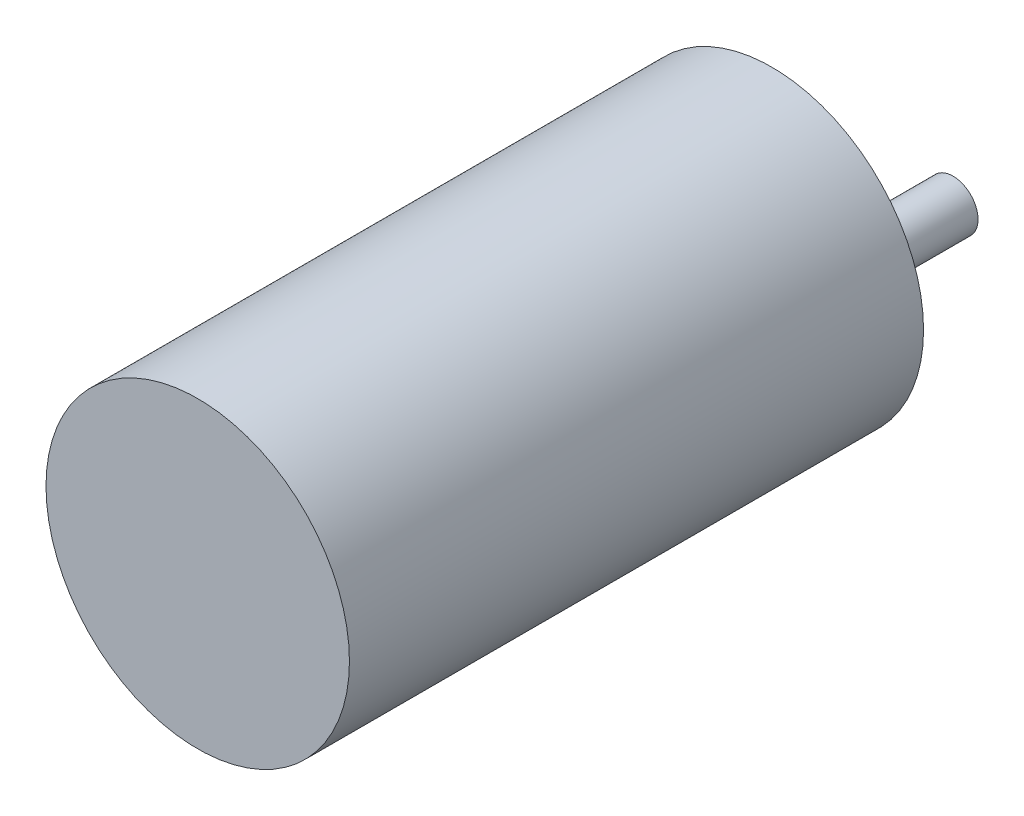
ISO-10303-21;
HEADER;
FILE_DESCRIPTION(('STEP AP214'),'2;1');
FILE_NAME('part.step','',(''),(''),'','','');
FILE_SCHEMA(('AUTOMOTIVE_DESIGN { 1 0 10303 214 1 1 1 1 }'));
ENDSEC;
DATA;
#1=APPLICATION_CONTEXT('core data for automotive mechanical design processes');
#2=APPLICATION_PROTOCOL_DEFINITION('international standard','automotive_design',2000,#1);
#3=PRODUCT_CONTEXT('',#1,'mechanical');
#4=PRODUCT('Part','Part','',(#3));
#5=PRODUCT_RELATED_PRODUCT_CATEGORY('part','',(#4));
#6=PRODUCT_DEFINITION_FORMATION('','',#4);
#7=PRODUCT_DEFINITION_CONTEXT('part definition',#1,'design');
#8=PRODUCT_DEFINITION('design','',#6,#7);
#9=PRODUCT_DEFINITION_SHAPE('','',#8);
#10=(LENGTH_UNIT() NAMED_UNIT(*) SI_UNIT(.MILLI.,.METRE.));
#11=(NAMED_UNIT(*) PLANE_ANGLE_UNIT() SI_UNIT($,.RADIAN.));
#12=(NAMED_UNIT(*) SI_UNIT($,.STERADIAN.) SOLID_ANGLE_UNIT());
#13=UNCERTAINTY_MEASURE_WITH_UNIT(LENGTH_MEASURE(1.E-05),#10,'distance_accuracy_value','');
#14=(GEOMETRIC_REPRESENTATION_CONTEXT(3) GLOBAL_UNCERTAINTY_ASSIGNED_CONTEXT((#13)) GLOBAL_UNIT_ASSIGNED_CONTEXT((#10,
#11,#12)) REPRESENTATION_CONTEXT('',''));
#15=CARTESIAN_POINT('',(0.,0.,0.));
#16=DIRECTION('',(0.,0.,1.));
#17=DIRECTION('',(1.,0.,0.));
#18=AXIS2_PLACEMENT_3D('',#15,#16,#17);
#19=CARTESIAN_POINT('',(0.,0.,70.));
#20=DIRECTION('',(0.,0.,-1.));
#21=DIRECTION('',(-1.,0.,0.));
#22=AXIS2_PLACEMENT_3D('',#19,#20,#21);
#23=CYLINDRICAL_SURFACE('',#22,18.5);
#24=CARTESIAN_POINT('',(0.,0.,70.));
#25=DIRECTION('',(0.,0.,1.));
#26=DIRECTION('',(1.,0.,0.));
#27=AXIS2_PLACEMENT_3D('',#24,#25,#26);
#28=CIRCLE('',#27,18.5);
#29=CARTESIAN_POINT('',(18.5,0.,70.));
#30=VERTEX_POINT('',#29);
#31=EDGE_CURVE('E41',#30,#30,#28,.T.);
#32=ORIENTED_EDGE('',*,*,#31,.F.);
#33=EDGE_LOOP('',(#32));
#34=FACE_BOUND('',#33,.T.);
#35=CARTESIAN_POINT('',(0.,0.,0.));
#36=DIRECTION('',(0.,0.,1.));
#37=DIRECTION('',(1.,0.,0.));
#38=AXIS2_PLACEMENT_3D('',#35,#36,#37);
#39=CIRCLE('',#38,18.5);
#40=CARTESIAN_POINT('',(18.5,0.,0.));
#41=VERTEX_POINT('',#40);
#42=EDGE_CURVE('E49',#41,#41,#39,.T.);
#43=ORIENTED_EDGE('',*,*,#42,.T.);
#44=EDGE_LOOP('',(#43));
#45=FACE_BOUND('',#44,.T.);
#46=ADVANCED_FACE('F30',(#34,#45),#23,.T.);
#47=CARTESIAN_POINT('',(0.,0.,70.));
#48=DIRECTION('',(0.,0.,1.));
#49=DIRECTION('',(1.,0.,0.));
#50=AXIS2_PLACEMENT_3D('',#47,#48,#49);
#51=PLANE('',#50);
#52=ORIENTED_EDGE('',*,*,#31,.T.);
#53=EDGE_LOOP('',(#52));
#54=FACE_BOUND('',#53,.T.);
#55=ADVANCED_FACE('F58',(#54),#51,.T.);
#56=CARTESIAN_POINT('',(0.,0.,0.));
#57=DIRECTION('',(0.,0.,1.));
#58=DIRECTION('',(1.,0.,0.));
#59=AXIS2_PLACEMENT_3D('',#56,#57,#58);
#60=PLANE('',#59);
#61=CARTESIAN_POINT('',(15.2766,0.,0.));
#62=DIRECTION('',(0.,0.,-1.));
#63=DIRECTION('',(-1.,0.,0.));
#64=AXIS2_PLACEMENT_3D('',#61,#62,#63);
#65=CIRCLE('',#64,1.6);
#66=CARTESIAN_POINT('',(13.6766,0.,0.));
#67=VERTEX_POINT('',#66);
#68=EDGE_CURVE('E246',#67,#67,#65,.T.);
#69=ORIENTED_EDGE('',*,*,#68,.F.);
#70=EDGE_LOOP('',(#69));
#71=FACE_BOUND('',#70,.T.);
#72=CARTESIAN_POINT('',(-7.79422931496333,13.2140965368011,0.));
#73=DIRECTION('',(0.,0.,-1.));
#74=DIRECTION('',(-1.,0.,0.));
#75=AXIS2_PLACEMENT_3D('',#72,#73,#74);
#76=CIRCLE('',#75,1.6);
#77=CARTESIAN_POINT('',(-9.39422931496333,13.2140965368011,0.));
#78=VERTEX_POINT('',#77);
#79=EDGE_CURVE('E257',#78,#78,#76,.T.);
#80=ORIENTED_EDGE('',*,*,#79,.F.);
#81=EDGE_LOOP('',(#80));
#82=FACE_BOUND('',#81,.T.);
#83=CARTESIAN_POINT('',(7.79422931496333,13.2140965368011,0.));
#84=DIRECTION('',(0.,0.,-1.));
#85=DIRECTION('',(-1.,0.,0.));
#86=AXIS2_PLACEMENT_3D('',#83,#84,#85);
#87=CIRCLE('',#86,1.6);
#88=CARTESIAN_POINT('',(6.19422931496333,13.2140965368011,0.));
#89=VERTEX_POINT('',#88);
#90=EDGE_CURVE('E256',#89,#89,#87,.T.);
#91=ORIENTED_EDGE('',*,*,#90,.F.);
#92=EDGE_LOOP('',(#91));
#93=FACE_BOUND('',#92,.T.);
#94=CARTESIAN_POINT('',(7.79422931496333,-13.5675408579338,0.));
#95=DIRECTION('',(0.,0.,-1.));
#96=DIRECTION('',(-1.,0.,0.));
#97=AXIS2_PLACEMENT_3D('',#94,#95,#96);
#98=CIRCLE('',#97,1.6);
#99=CARTESIAN_POINT('',(6.19422931496333,-13.5675408579338,0.));
#100=VERTEX_POINT('',#99);
#101=EDGE_CURVE('E274',#100,#100,#98,.T.);
#102=ORIENTED_EDGE('',*,*,#101,.F.);
#103=EDGE_LOOP('',(#102));
#104=FACE_BOUND('',#103,.T.);
#105=CARTESIAN_POINT('',(-7.79422931496334,-13.5675408579338,0.));
#106=DIRECTION('',(0.,0.,-1.));
#107=DIRECTION('',(-1.,0.,0.));
#108=AXIS2_PLACEMENT_3D('',#105,#106,#107);
#109=CIRCLE('',#108,1.6);
#110=CARTESIAN_POINT('',(-9.39422931496334,-13.5675408579338,0.));
#111=VERTEX_POINT('',#110);
#112=EDGE_CURVE('E268',#111,#111,#109,.T.);
#113=ORIENTED_EDGE('',*,*,#112,.F.);
#114=EDGE_LOOP('',(#113));
#115=FACE_BOUND('',#114,.T.);
#116=CARTESIAN_POINT('',(-15.2766,0.,0.));
#117=DIRECTION('',(0.,0.,-1.));
#118=DIRECTION('',(-1.,0.,0.));
#119=AXIS2_PLACEMENT_3D('',#116,#117,#118);
#120=CIRCLE('',#119,1.6);
#121=CARTESIAN_POINT('',(-16.8766,0.,0.));
#122=VERTEX_POINT('',#121);
#123=EDGE_CURVE('E262',#122,#122,#120,.T.);
#124=ORIENTED_EDGE('',*,*,#123,.F.);
#125=EDGE_LOOP('',(#124));
#126=FACE_BOUND('',#125,.T.);
#127=CARTESIAN_POINT('',(0.,-7.112,0.));
#128=DIRECTION('',(0.,0.,1.));
#129=DIRECTION('',(1.,0.,0.));
#130=AXIS2_PLACEMENT_3D('',#127,#128,#129);
#131=CIRCLE('',#130,5.969);
#132=CARTESIAN_POINT('',(5.969,-7.112,0.));
#133=VERTEX_POINT('',#132);
#134=EDGE_CURVE('E33',#133,#133,#131,.F.);
#135=ORIENTED_EDGE('',*,*,#134,.F.);
#136=EDGE_LOOP('',(#135));
#137=FACE_BOUND('',#136,.T.);
#138=ORIENTED_EDGE('',*,*,#42,.F.);
#139=EDGE_LOOP('',(#138));
#140=FACE_BOUND('',#139,.T.);
#141=ADVANCED_FACE('F55',(#71,#82,#93,#104,#115,#126,#137,#140),#60,.F.);
#142=CARTESIAN_POINT('',(0.,-7.112,-6.096));
#143=DIRECTION('',(0.,0.,1.));
#144=DIRECTION('',(1.,0.,0.));
#145=AXIS2_PLACEMENT_3D('',#142,#143,#144);
#146=CYLINDRICAL_SURFACE('',#145,5.969);
#147=CARTESIAN_POINT('',(0.,-7.112,-6.096));
#148=DIRECTION('',(0.,0.,-1.));
#149=DIRECTION('',(-1.,0.,0.));
#150=AXIS2_PLACEMENT_3D('',#147,#148,#149);
#151=CIRCLE('',#150,5.969);
#152=CARTESIAN_POINT('',(-5.969,-7.112,-6.096));
#153=VERTEX_POINT('',#152);
#154=EDGE_CURVE('E46',#153,#153,#151,.T.);
#155=ORIENTED_EDGE('',*,*,#154,.F.);
#156=EDGE_LOOP('',(#155));
#157=FACE_BOUND('',#156,.T.);
#158=ORIENTED_EDGE('',*,*,#134,.T.);
#159=EDGE_LOOP('',(#158));
#160=FACE_BOUND('',#159,.T.);
#161=ADVANCED_FACE('F57',(#157,#160),#146,.T.);
#162=CARTESIAN_POINT('',(0.,-7.112,-6.096));
#163=DIRECTION('',(0.,0.,-1.));
#164=DIRECTION('',(-1.,0.,0.));
#165=AXIS2_PLACEMENT_3D('',#162,#163,#164);
#166=PLANE('',#165);
#167=CARTESIAN_POINT('',(0.,-7.112,-6.096));
#168=DIRECTION('',(0.,0.,-1.));
#169=DIRECTION('',(-1.,0.,0.));
#170=AXIS2_PLACEMENT_3D('',#167,#168,#169);
#171=CIRCLE('',#170,3.048);
#172=CARTESIAN_POINT('',(-3.048,-7.112,-6.096));
#173=VERTEX_POINT('',#172);
#174=EDGE_CURVE('E10',#173,#173,#171,.T.);
#175=ORIENTED_EDGE('',*,*,#174,.F.);
#176=EDGE_LOOP('',(#175));
#177=FACE_BOUND('',#176,.T.);
#178=ORIENTED_EDGE('',*,*,#154,.T.);
#179=EDGE_LOOP('',(#178));
#180=FACE_BOUND('',#179,.T.);
#181=ADVANCED_FACE('F64',(#177,#180),#166,.T.);
#182=CARTESIAN_POINT('',(0.,-7.112,-22.098));
#183=DIRECTION('',(0.,0.,1.));
#184=DIRECTION('',(1.,0.,0.));
#185=AXIS2_PLACEMENT_3D('',#182,#183,#184);
#186=CYLINDRICAL_SURFACE('',#185,3.048);
#187=CARTESIAN_POINT('',(0.,-7.112,-22.098));
#188=DIRECTION('',(0.,0.,-1.));
#189=DIRECTION('',(-1.,0.,0.));
#190=AXIS2_PLACEMENT_3D('',#187,#188,#189);
#191=CIRCLE('',#190,3.048);
#192=CARTESIAN_POINT('',(-3.048,-7.112,-22.098));
#193=VERTEX_POINT('',#192);
#194=EDGE_CURVE('E44',#193,#193,#191,.T.);
#195=ORIENTED_EDGE('',*,*,#194,.F.);
#196=EDGE_LOOP('',(#195));
#197=FACE_BOUND('',#196,.T.);
#198=ORIENTED_EDGE('',*,*,#174,.T.);
#199=EDGE_LOOP('',(#198));
#200=FACE_BOUND('',#199,.T.);
#201=ADVANCED_FACE('F96',(#197,#200),#186,.T.);
#202=CARTESIAN_POINT('',(0.,-7.112,-22.098));
#203=DIRECTION('',(0.,0.,-1.));
#204=DIRECTION('',(-1.,0.,0.));
#205=AXIS2_PLACEMENT_3D('',#202,#203,#204);
#206=PLANE('',#205);
#207=ORIENTED_EDGE('',*,*,#194,.T.);
#208=EDGE_LOOP('',(#207));
#209=FACE_BOUND('',#208,.T.);
#210=ADVANCED_FACE('F106',(#209),#206,.T.);
#211=CARTESIAN_POINT('',(-15.2766,0.,3.));
#212=DIRECTION('',(0.,0.,-1.));
#213=DIRECTION('',(-1.,0.,0.));
#214=AXIS2_PLACEMENT_3D('',#211,#212,#213);
#215=CYLINDRICAL_SURFACE('',#214,1.6);
#216=CARTESIAN_POINT('',(-15.2766,0.,3.));
#217=DIRECTION('',(0.,0.,-1.));
#218=DIRECTION('',(-1.,0.,0.));
#219=AXIS2_PLACEMENT_3D('',#216,#217,#218);
#220=CIRCLE('',#219,1.6);
#221=CARTESIAN_POINT('',(-16.8766,0.,3.));
#222=VERTEX_POINT('',#221);
#223=EDGE_CURVE('E250',#222,#222,#220,.T.);
#224=ORIENTED_EDGE('',*,*,#223,.F.);
#225=EDGE_LOOP('',(#224));
#226=FACE_BOUND('',#225,.T.);
#227=ORIENTED_EDGE('',*,*,#123,.T.);
#228=EDGE_LOOP('',(#227));
#229=FACE_BOUND('',#228,.T.);
#230=ADVANCED_FACE('F115',(#226,#229),#215,.F.);
#231=CARTESIAN_POINT('',(-15.2766,0.,3.));
#232=DIRECTION('',(0.,0.,-1.));
#233=DIRECTION('',(-1.,0.,0.));
#234=AXIS2_PLACEMENT_3D('',#231,#232,#233);
#235=PLANE('',#234);
#236=ORIENTED_EDGE('',*,*,#223,.T.);
#237=EDGE_LOOP('',(#236));
#238=FACE_BOUND('',#237,.T.);
#239=ADVANCED_FACE('F129',(#238),#235,.T.);
#240=CARTESIAN_POINT('',(-7.79422931496334,-13.5675408579338,3.));
#241=DIRECTION('',(0.,0.,-1.));
#242=DIRECTION('',(-1.,0.,0.));
#243=AXIS2_PLACEMENT_3D('',#240,#241,#242);
#244=CYLINDRICAL_SURFACE('',#243,1.6);
#245=CARTESIAN_POINT('',(-7.79422931496334,-13.5675408579338,3.));
#246=DIRECTION('',(0.,0.,-1.));
#247=DIRECTION('',(-1.,0.,0.));
#248=AXIS2_PLACEMENT_3D('',#245,#246,#247);
#249=CIRCLE('',#248,1.6);
#250=CARTESIAN_POINT('',(-9.39422931496334,-13.5675408579338,3.));
#251=VERTEX_POINT('',#250);
#252=EDGE_CURVE('E265',#251,#251,#249,.T.);
#253=ORIENTED_EDGE('',*,*,#252,.F.);
#254=EDGE_LOOP('',(#253));
#255=FACE_BOUND('',#254,.T.);
#256=ORIENTED_EDGE('',*,*,#112,.T.);
#257=EDGE_LOOP('',(#256));
#258=FACE_BOUND('',#257,.T.);
#259=ADVANCED_FACE('F139',(#255,#258),#244,.F.);
#260=CARTESIAN_POINT('',(-7.79422931496334,-13.5675408579338,3.));
#261=DIRECTION('',(0.,0.,-1.));
#262=DIRECTION('',(-1.,0.,0.));
#263=AXIS2_PLACEMENT_3D('',#260,#261,#262);
#264=PLANE('',#263);
#265=ORIENTED_EDGE('',*,*,#252,.T.);
#266=EDGE_LOOP('',(#265));
#267=FACE_BOUND('',#266,.T.);
#268=ADVANCED_FACE('F149',(#267),#264,.T.);
#269=CARTESIAN_POINT('',(7.79422931496333,-13.5675408579338,3.));
#270=DIRECTION('',(0.,0.,-1.));
#271=DIRECTION('',(-1.,0.,0.));
#272=AXIS2_PLACEMENT_3D('',#269,#270,#271);
#273=CYLINDRICAL_SURFACE('',#272,1.6);
#274=CARTESIAN_POINT('',(7.79422931496333,-13.5675408579338,3.));
#275=DIRECTION('',(0.,0.,-1.));
#276=DIRECTION('',(-1.,0.,0.));
#277=AXIS2_PLACEMENT_3D('',#274,#275,#276);
#278=CIRCLE('',#277,1.6);
#279=CARTESIAN_POINT('',(6.19422931496333,-13.5675408579338,3.));
#280=VERTEX_POINT('',#279);
#281=EDGE_CURVE('E271',#280,#280,#278,.T.);
#282=ORIENTED_EDGE('',*,*,#281,.F.);
#283=EDGE_LOOP('',(#282));
#284=FACE_BOUND('',#283,.T.);
#285=ORIENTED_EDGE('',*,*,#101,.T.);
#286=EDGE_LOOP('',(#285));
#287=FACE_BOUND('',#286,.T.);
#288=ADVANCED_FACE('F159',(#284,#287),#273,.F.);
#289=CARTESIAN_POINT('',(7.79422931496333,-13.5675408579338,3.));
#290=DIRECTION('',(0.,0.,-1.));
#291=DIRECTION('',(-1.,0.,0.));
#292=AXIS2_PLACEMENT_3D('',#289,#290,#291);
#293=PLANE('',#292);
#294=ORIENTED_EDGE('',*,*,#281,.T.);
#295=EDGE_LOOP('',(#294));
#296=FACE_BOUND('',#295,.T.);
#297=ADVANCED_FACE('F169',(#296),#293,.T.);
#298=CARTESIAN_POINT('',(7.79422931496333,13.2140965368011,3.));
#299=DIRECTION('',(0.,0.,-1.));
#300=DIRECTION('',(-1.,0.,0.));
#301=AXIS2_PLACEMENT_3D('',#298,#299,#300);
#302=CYLINDRICAL_SURFACE('',#301,1.6);
#303=CARTESIAN_POINT('',(7.79422931496333,13.2140965368011,3.));
#304=DIRECTION('',(0.,0.,-1.));
#305=DIRECTION('',(-1.,0.,0.));
#306=AXIS2_PLACEMENT_3D('',#303,#304,#305);
#307=CIRCLE('',#306,1.6);
#308=CARTESIAN_POINT('',(6.19422931496333,13.2140965368011,3.));
#309=VERTEX_POINT('',#308);
#310=EDGE_CURVE('E277',#309,#309,#307,.T.);
#311=ORIENTED_EDGE('',*,*,#310,.F.);
#312=EDGE_LOOP('',(#311));
#313=FACE_BOUND('',#312,.T.);
#314=ORIENTED_EDGE('',*,*,#90,.T.);
#315=EDGE_LOOP('',(#314));
#316=FACE_BOUND('',#315,.T.);
#317=ADVANCED_FACE('F179',(#313,#316),#302,.F.);
#318=CARTESIAN_POINT('',(7.79422931496333,13.2140965368011,3.));
#319=DIRECTION('',(0.,0.,-1.));
#320=DIRECTION('',(-1.,0.,0.));
#321=AXIS2_PLACEMENT_3D('',#318,#319,#320);
#322=PLANE('',#321);
#323=ORIENTED_EDGE('',*,*,#310,.T.);
#324=EDGE_LOOP('',(#323));
#325=FACE_BOUND('',#324,.T.);
#326=ADVANCED_FACE('F189',(#325),#322,.T.);
#327=CARTESIAN_POINT('',(-7.79422931496333,13.2140965368011,3.));
#328=DIRECTION('',(0.,0.,-1.));
#329=DIRECTION('',(-1.,0.,0.));
#330=AXIS2_PLACEMENT_3D('',#327,#328,#329);
#331=CYLINDRICAL_SURFACE('',#330,1.6);
#332=CARTESIAN_POINT('',(-7.79422931496333,13.2140965368011,3.));
#333=DIRECTION('',(0.,0.,-1.));
#334=DIRECTION('',(-1.,0.,0.));
#335=AXIS2_PLACEMENT_3D('',#332,#333,#334);
#336=CIRCLE('',#335,1.6);
#337=CARTESIAN_POINT('',(-9.39422931496333,13.2140965368011,3.));
#338=VERTEX_POINT('',#337);
#339=EDGE_CURVE('E253',#338,#338,#336,.T.);
#340=ORIENTED_EDGE('',*,*,#339,.F.);
#341=EDGE_LOOP('',(#340));
#342=FACE_BOUND('',#341,.T.);
#343=ORIENTED_EDGE('',*,*,#79,.T.);
#344=EDGE_LOOP('',(#343));
#345=FACE_BOUND('',#344,.T.);
#346=ADVANCED_FACE('F199',(#342,#345),#331,.F.);
#347=CARTESIAN_POINT('',(-7.79422931496333,13.2140965368011,3.));
#348=DIRECTION('',(0.,0.,-1.));
#349=DIRECTION('',(-1.,0.,0.));
#350=AXIS2_PLACEMENT_3D('',#347,#348,#349);
#351=PLANE('',#350);
#352=ORIENTED_EDGE('',*,*,#339,.T.);
#353=EDGE_LOOP('',(#352));
#354=FACE_BOUND('',#353,.T.);
#355=ADVANCED_FACE('F209',(#354),#351,.T.);
#356=CARTESIAN_POINT('',(15.2766,0.,3.));
#357=DIRECTION('',(0.,0.,-1.));
#358=DIRECTION('',(-1.,0.,0.));
#359=AXIS2_PLACEMENT_3D('',#356,#357,#358);
#360=CYLINDRICAL_SURFACE('',#359,1.6);
#361=CARTESIAN_POINT('',(15.2766,0.,3.));
#362=DIRECTION('',(0.,0.,-1.));
#363=DIRECTION('',(-1.,0.,0.));
#364=AXIS2_PLACEMENT_3D('',#361,#362,#363);
#365=CIRCLE('',#364,1.6);
#366=CARTESIAN_POINT('',(13.6766,0.,3.));
#367=VERTEX_POINT('',#366);
#368=EDGE_CURVE('E245',#367,#367,#365,.T.);
#369=ORIENTED_EDGE('',*,*,#368,.F.);
#370=EDGE_LOOP('',(#369));
#371=FACE_BOUND('',#370,.T.);
#372=ORIENTED_EDGE('',*,*,#68,.T.);
#373=EDGE_LOOP('',(#372));
#374=FACE_BOUND('',#373,.T.);
#375=ADVANCED_FACE('F219',(#371,#374),#360,.F.);
#376=CARTESIAN_POINT('',(15.2766,0.,3.));
#377=DIRECTION('',(0.,0.,-1.));
#378=DIRECTION('',(-1.,0.,0.));
#379=AXIS2_PLACEMENT_3D('',#376,#377,#378);
#380=PLANE('',#379);
#381=ORIENTED_EDGE('',*,*,#368,.T.);
#382=EDGE_LOOP('',(#381));
#383=FACE_BOUND('',#382,.T.);
#384=ADVANCED_FACE('F229',(#383),#380,.T.);
#385=CLOSED_SHELL('',(#46,#55,#141,#161,#181,#201,#210,#230,#239,#259,#268,#288,#297,#317,#326,
#346,#355,#375,#384));
#386=MANIFOLD_SOLID_BREP('B2',#385);
#387=ADVANCED_BREP_SHAPE_REPRESENTATION('',(#18,#386),#14);
#388=SHAPE_DEFINITION_REPRESENTATION(#9,#387);
ENDSEC;
END-ISO-10303-21;
